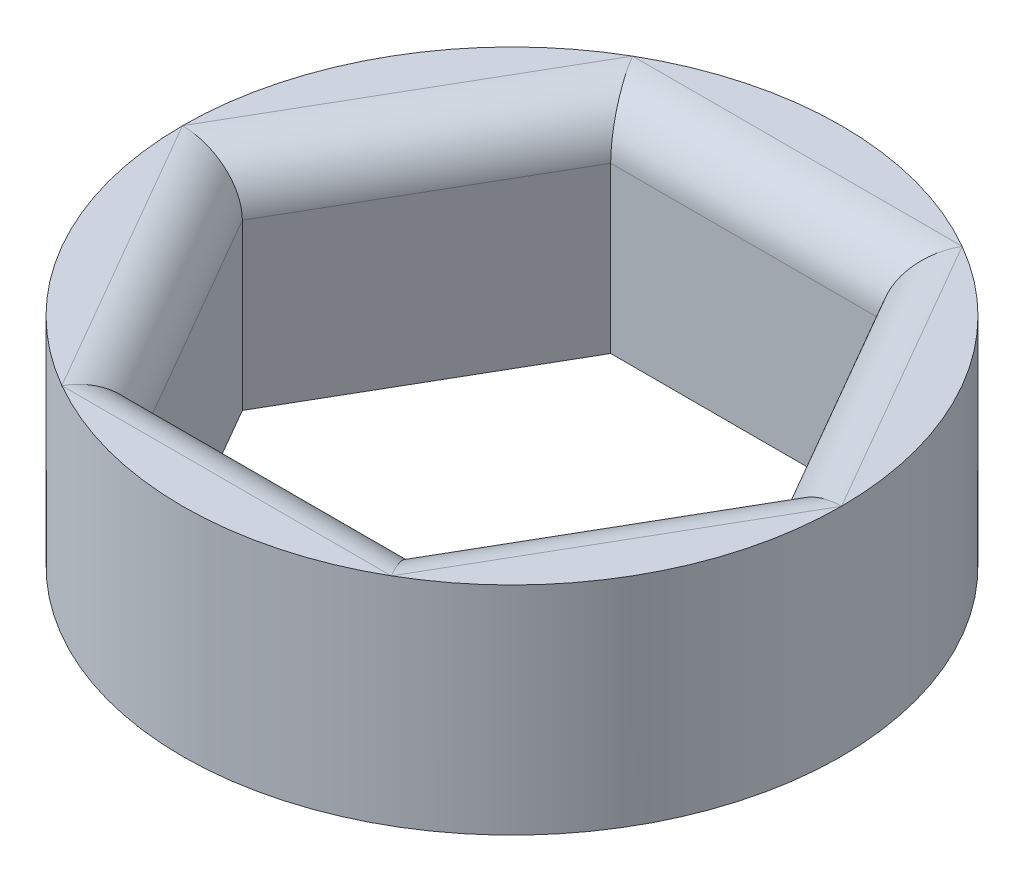
ISO-10303-21;
HEADER;
FILE_DESCRIPTION(('STEP AP214'),'2;1');
FILE_NAME('part.step','',(''),(''),'','','');
FILE_SCHEMA(('AUTOMOTIVE_DESIGN { 1 0 10303 214 1 1 1 1 }'));
ENDSEC;
DATA;
#1=APPLICATION_CONTEXT('core data for automotive mechanical design processes');
#2=APPLICATION_PROTOCOL_DEFINITION('international standard','automotive_design',2000,#1);
#3=PRODUCT_CONTEXT('',#1,'mechanical');
#4=PRODUCT('Part','Part','',(#3));
#5=PRODUCT_RELATED_PRODUCT_CATEGORY('part','',(#4));
#6=PRODUCT_DEFINITION_FORMATION('','',#4);
#7=PRODUCT_DEFINITION_CONTEXT('part definition',#1,'design');
#8=PRODUCT_DEFINITION('design','',#6,#7);
#9=PRODUCT_DEFINITION_SHAPE('','',#8);
#10=(LENGTH_UNIT() NAMED_UNIT(*) SI_UNIT(.MILLI.,.METRE.));
#11=(NAMED_UNIT(*) PLANE_ANGLE_UNIT() SI_UNIT($,.RADIAN.));
#12=(NAMED_UNIT(*) SI_UNIT($,.STERADIAN.) SOLID_ANGLE_UNIT());
#13=UNCERTAINTY_MEASURE_WITH_UNIT(LENGTH_MEASURE(1.E-05),#10,'distance_accuracy_value','');
#14=(GEOMETRIC_REPRESENTATION_CONTEXT(3) GLOBAL_UNCERTAINTY_ASSIGNED_CONTEXT((#13)) GLOBAL_UNIT_ASSIGNED_CONTEXT((#10,
#11,#12)) REPRESENTATION_CONTEXT('',''));
#15=CARTESIAN_POINT('',(0.,0.,0.));
#16=DIRECTION('',(0.,0.,1.));
#17=DIRECTION('',(1.,0.,0.));
#18=AXIS2_PLACEMENT_3D('',#15,#16,#17);
#19=CARTESIAN_POINT('',(0.,4.175,0.));
#20=DIRECTION('',(0.,1.,0.));
#21=DIRECTION('',(0.,0.,1.));
#22=AXIS2_PLACEMENT_3D('',#19,#20,#21);
#23=PLANE('',#22);
#24=CARTESIAN_POINT('',(0.,4.175,0.));
#25=DIRECTION('',(0.,1.,0.));
#26=DIRECTION('',(0.,0.,1.));
#27=AXIS2_PLACEMENT_3D('',#24,#25,#26);
#28=CIRCLE('',#27,6.35);
#29=CARTESIAN_POINT('',(3.17372021451167,4.175,-5.5));
#30=VERTEX_POINT('',#29);
#31=CARTESIAN_POINT('',(-3.17372021451167,4.175,-5.5));
#32=VERTEX_POINT('',#31);
#33=EDGE_CURVE('E349',#30,#32,#28,.T.);
#34=ORIENTED_EDGE('',*,*,#33,.T.);
#35=DIRECTION('',(-1.,0.,0.));
#36=VECTOR('',#35,1.);
#37=CARTESIAN_POINT('',(0.,4.175,-5.5));
#38=LINE('',#37,#36);
#39=EDGE_CURVE('E232',#32,#30,#38,.F.);
#40=ORIENTED_EDGE('',*,*,#39,.T.);
#41=EDGE_LOOP('',(#34,#40));
#42=FACE_BOUND('',#41,.T.);
#43=ADVANCED_FACE('F39',(#42),#23,.T.);
#44=CARTESIAN_POINT('',(-6.34999982807025,4.175,0.00147766972869714));
#45=VERTEX_POINT('',#44);
#46=CARTESIAN_POINT('',(-3.17627961355858,4.175,5.4985223302713));
#47=VERTEX_POINT('',#46);
#48=EDGE_CURVE('E377',#45,#47,#28,.T.);
#49=ORIENTED_EDGE('',*,*,#48,.T.);
#50=DIRECTION('',(0.5,0.,0.866025403784439));
#51=VECTOR('',#50,1.);
#52=CARTESIAN_POINT('',(-4.76313972081442,4.175,2.75));
#53=LINE('',#52,#51);
#54=EDGE_CURVE('E229',#47,#45,#53,.F.);
#55=ORIENTED_EDGE('',*,*,#54,.T.);
#56=EDGE_LOOP('',(#49,#55));
#57=FACE_BOUND('',#56,.T.);
#58=ADVANCED_FACE('F309',(#57),#23,.T.);
#59=CARTESIAN_POINT('',(-3.17372021451167,4.175,5.5));
#60=VERTEX_POINT('',#59);
#61=CARTESIAN_POINT('',(3.17372021451167,4.175,5.5));
#62=VERTEX_POINT('',#61);
#63=EDGE_CURVE('E210',#60,#62,#28,.T.);
#64=ORIENTED_EDGE('',*,*,#63,.T.);
#65=DIRECTION('',(1.,0.,0.));
#66=VECTOR('',#65,1.);
#67=CARTESIAN_POINT('',(0.,4.175,5.5));
#68=LINE('',#67,#66);
#69=EDGE_CURVE('E226',#62,#60,#68,.F.);
#70=ORIENTED_EDGE('',*,*,#69,.T.);
#71=EDGE_LOOP('',(#64,#70));
#72=FACE_BOUND('',#71,.T.);
#73=ADVANCED_FACE('F316',(#72),#23,.T.);
#74=CARTESIAN_POINT('',(3.17627961355858,4.175,5.4985223302713));
#75=VERTEX_POINT('',#74);
#76=CARTESIAN_POINT('',(6.34999982807025,4.175,0.00147766972869324));
#77=VERTEX_POINT('',#76);
#78=EDGE_CURVE('E365',#75,#77,#28,.T.);
#79=ORIENTED_EDGE('',*,*,#78,.T.);
#80=DIRECTION('',(0.5,0.,-0.866025403784439));
#81=VECTOR('',#80,1.);
#82=CARTESIAN_POINT('',(4.76313972081441,4.175,2.75));
#83=LINE('',#82,#81);
#84=EDGE_CURVE('E223',#77,#75,#83,.F.);
#85=ORIENTED_EDGE('',*,*,#84,.T.);
#86=EDGE_LOOP('',(#79,#85));
#87=FACE_BOUND('',#86,.T.);
#88=ADVANCED_FACE('F330',(#87),#23,.T.);
#89=CARTESIAN_POINT('',(6.34999982807025,4.175,-0.00147766972869194));
#90=VERTEX_POINT('',#89);
#91=CARTESIAN_POINT('',(3.17627961355858,4.175,-5.49852233027131));
#92=VERTEX_POINT('',#91);
#93=EDGE_CURVE('E358',#90,#92,#28,.T.);
#94=ORIENTED_EDGE('',*,*,#93,.T.);
#95=DIRECTION('',(-0.5,0.,-0.866025403784439));
#96=VECTOR('',#95,1.);
#97=CARTESIAN_POINT('',(4.76313972081441,4.175,-2.75));
#98=LINE('',#97,#96);
#99=EDGE_CURVE('E220',#92,#90,#98,.F.);
#100=ORIENTED_EDGE('',*,*,#99,.T.);
#101=EDGE_LOOP('',(#94,#100));
#102=FACE_BOUND('',#101,.T.);
#103=ADVANCED_FACE('F322',(#102),#23,.T.);
#104=CARTESIAN_POINT('',(-3.17627961355858,4.175,-5.4985223302713));
#105=VERTEX_POINT('',#104);
#106=CARTESIAN_POINT('',(-6.34999982807025,4.175,-0.00147766972869454));
#107=VERTEX_POINT('',#106);
#108=EDGE_CURVE('E334',#105,#107,#28,.T.);
#109=ORIENTED_EDGE('',*,*,#108,.T.);
#110=DIRECTION('',(-0.5,0.,0.866025403784439));
#111=VECTOR('',#110,1.);
#112=CARTESIAN_POINT('',(-4.76313972081441,4.175,-2.75));
#113=LINE('',#112,#111);
#114=EDGE_CURVE('E217',#107,#105,#113,.F.);
#115=ORIENTED_EDGE('',*,*,#114,.T.);
#116=EDGE_LOOP('',(#109,#115));
#117=FACE_BOUND('',#116,.T.);
#118=ADVANCED_FACE('F312',(#117),#23,.T.);
#119=CARTESIAN_POINT('',(0.,0.,0.));
#120=DIRECTION('',(0.,1.,0.));
#121=DIRECTION('',(0.,0.,1.));
#122=AXIS2_PLACEMENT_3D('',#119,#120,#121);
#123=PLANE('',#122);
#124=CARTESIAN_POINT('',(0.,0.,0.));
#125=DIRECTION('',(0.,1.,0.));
#126=DIRECTION('',(0.,0.,1.));
#127=AXIS2_PLACEMENT_3D('',#124,#125,#126);
#128=CIRCLE('',#127,6.35);
#129=CARTESIAN_POINT('',(0.,0.,6.35));
#130=VERTEX_POINT('',#129);
#131=EDGE_CURVE('E156',#130,#130,#128,.T.);
#132=ORIENTED_EDGE('',*,*,#131,.F.);
#133=EDGE_LOOP('',(#132));
#134=FACE_BOUND('',#133,.T.);
#135=DIRECTION('',(0.5,0.,-0.866025403784439));
#136=VECTOR('',#135,1.);
#137=CARTESIAN_POINT('',(2.59807621135331,0.,4.5));
#138=LINE('',#137,#136);
#139=CARTESIAN_POINT('',(2.59807621135331,0.,4.5));
#140=VERTEX_POINT('',#139);
#141=CARTESIAN_POINT('',(5.19615242270663,0.,0.));
#142=VERTEX_POINT('',#141);
#143=EDGE_CURVE('E151',#140,#142,#138,.T.);
#144=ORIENTED_EDGE('',*,*,#143,.T.);
#145=DIRECTION('',(-0.5,0.,-0.866025403784439));
#146=VECTOR('',#145,1.);
#147=CARTESIAN_POINT('',(5.19615242270663,0.,0.));
#148=LINE('',#147,#146);
#149=CARTESIAN_POINT('',(2.59807621135331,0.,-4.5));
#150=VERTEX_POINT('',#149);
#151=EDGE_CURVE('E160',#142,#150,#148,.T.);
#152=ORIENTED_EDGE('',*,*,#151,.T.);
#153=DIRECTION('',(-1.,0.,0.));
#154=VECTOR('',#153,1.);
#155=CARTESIAN_POINT('',(2.59807621135331,0.,-4.5));
#156=LINE('',#155,#154);
#157=CARTESIAN_POINT('',(-2.59807621135332,0.,-4.5));
#158=VERTEX_POINT('',#157);
#159=EDGE_CURVE('E167',#150,#158,#156,.T.);
#160=ORIENTED_EDGE('',*,*,#159,.T.);
#161=DIRECTION('',(-0.5,0.,0.866025403784439));
#162=VECTOR('',#161,1.);
#163=CARTESIAN_POINT('',(-2.59807621135332,0.,-4.5));
#164=LINE('',#163,#162);
#165=CARTESIAN_POINT('',(-5.19615242270663,0.,0.));
#166=VERTEX_POINT('',#165);
#167=EDGE_CURVE('E181',#158,#166,#164,.T.);
#168=ORIENTED_EDGE('',*,*,#167,.T.);
#169=DIRECTION('',(0.5,0.,0.866025403784439));
#170=VECTOR('',#169,1.);
#171=CARTESIAN_POINT('',(-5.19615242270663,0.,0.));
#172=LINE('',#171,#170);
#173=CARTESIAN_POINT('',(-2.59807621135332,0.,4.5));
#174=VERTEX_POINT('',#173);
#175=EDGE_CURVE('E185',#166,#174,#172,.T.);
#176=ORIENTED_EDGE('',*,*,#175,.T.);
#177=DIRECTION('',(1.,0.,0.));
#178=VECTOR('',#177,1.);
#179=CARTESIAN_POINT('',(-2.59807621135332,0.,4.5));
#180=LINE('',#179,#178);
#181=EDGE_CURVE('E172',#174,#140,#180,.T.);
#182=ORIENTED_EDGE('',*,*,#181,.T.);
#183=EDGE_LOOP('',(#144,#152,#160,#168,#176,#182));
#184=FACE_BOUND('',#183,.T.);
#185=ADVANCED_FACE('F169',(#134,#184),#123,.F.);
#186=CARTESIAN_POINT('',(0.,4.175,0.));
#187=DIRECTION('',(0.,-1.,0.));
#188=DIRECTION('',(0.,0.,-1.));
#189=AXIS2_PLACEMENT_3D('',#186,#187,#188);
#190=CYLINDRICAL_SURFACE('',#189,6.35);
#191=CARTESIAN_POINT('',(3.175,4.175,5.49926131403119));
#192=VERTEX_POINT('',#191);
#193=EDGE_CURVE('E204',#62,#192,#28,.T.);
#194=ORIENTED_EDGE('',*,*,#193,.F.);
#195=ORIENTED_EDGE('',*,*,#63,.F.);
#196=CARTESIAN_POINT('',(-3.175,4.175,5.49926131403118));
#197=VERTEX_POINT('',#196);
#198=EDGE_CURVE('E272',#197,#60,#28,.T.);
#199=ORIENTED_EDGE('',*,*,#198,.F.);
#200=EDGE_CURVE('E268',#47,#197,#28,.T.);
#201=ORIENTED_EDGE('',*,*,#200,.F.);
#202=ORIENTED_EDGE('',*,*,#48,.F.);
#203=CARTESIAN_POINT('',(-6.35,4.175,0.));
#204=VERTEX_POINT('',#203);
#205=EDGE_CURVE('E380',#204,#45,#28,.T.);
#206=ORIENTED_EDGE('',*,*,#205,.F.);
#207=EDGE_CURVE('E340',#107,#204,#28,.T.);
#208=ORIENTED_EDGE('',*,*,#207,.F.);
#209=ORIENTED_EDGE('',*,*,#108,.F.);
#210=CARTESIAN_POINT('',(-3.175,4.175,-5.49926131403119));
#211=VERTEX_POINT('',#210);
#212=EDGE_CURVE('E339',#211,#105,#28,.T.);
#213=ORIENTED_EDGE('',*,*,#212,.F.);
#214=EDGE_CURVE('E347',#32,#211,#28,.T.);
#215=ORIENTED_EDGE('',*,*,#214,.F.);
#216=ORIENTED_EDGE('',*,*,#33,.F.);
#217=CARTESIAN_POINT('',(3.175,4.175,-5.49926131403119));
#218=VERTEX_POINT('',#217);
#219=EDGE_CURVE('E353',#218,#30,#28,.T.);
#220=ORIENTED_EDGE('',*,*,#219,.F.);
#221=EDGE_CURVE('E356',#92,#218,#28,.T.);
#222=ORIENTED_EDGE('',*,*,#221,.F.);
#223=ORIENTED_EDGE('',*,*,#93,.F.);
#224=CARTESIAN_POINT('',(6.35,4.175,0.));
#225=VERTEX_POINT('',#224);
#226=EDGE_CURVE('E361',#225,#90,#28,.T.);
#227=ORIENTED_EDGE('',*,*,#226,.F.);
#228=EDGE_CURVE('E281',#77,#225,#28,.T.);
#229=ORIENTED_EDGE('',*,*,#228,.F.);
#230=ORIENTED_EDGE('',*,*,#78,.F.);
#231=EDGE_CURVE('E209',#192,#75,#28,.T.);
#232=ORIENTED_EDGE('',*,*,#231,.F.);
#233=EDGE_LOOP('',(#194,#195,#199,#201,#202,#206,#208,#209,#213,#215,#216,#220,#222,#223,#227,
#229,#230,#232));
#234=FACE_BOUND('',#233,.T.);
#235=ORIENTED_EDGE('',*,*,#131,.T.);
#236=EDGE_LOOP('',(#235));
#237=FACE_BOUND('',#236,.T.);
#238=ADVANCED_FACE('F328',(#234,#237),#190,.T.);
#239=CARTESIAN_POINT('',(2.59807621135331,4.175,4.5));
#240=DIRECTION('',(-0.866025403784439,0.,-0.5));
#241=DIRECTION('',(-0.5,0.,0.866025403784439));
#242=AXIS2_PLACEMENT_3D('',#239,#240,#241);
#243=PLANE('',#242);
#244=DIRECTION('',(0.,-1.,0.));
#245=VECTOR('',#244,1.);
#246=CARTESIAN_POINT('',(2.59807621135331,4.175,4.5));
#247=LINE('',#246,#245);
#248=CARTESIAN_POINT('',(2.59807621135331,3.175,4.5));
#249=VERTEX_POINT('',#248);
#250=EDGE_CURVE('E190',#249,#140,#247,.T.);
#251=ORIENTED_EDGE('',*,*,#250,.F.);
#252=DIRECTION('',(0.5,0.,-0.866025403784439));
#253=VECTOR('',#252,1.);
#254=CARTESIAN_POINT('',(2.59807621135331,3.175,4.5));
#255=LINE('',#254,#253);
#256=CARTESIAN_POINT('',(5.19615242270663,3.175,0.));
#257=VERTEX_POINT('',#256);
#258=EDGE_CURVE('E57',#249,#257,#255,.T.);
#259=ORIENTED_EDGE('',*,*,#258,.T.);
#260=DIRECTION('',(0.,-1.,0.));
#261=VECTOR('',#260,1.);
#262=CARTESIAN_POINT('',(5.19615242270663,4.175,0.));
#263=LINE('',#262,#261);
#264=EDGE_CURVE('E147',#257,#142,#263,.T.);
#265=ORIENTED_EDGE('',*,*,#264,.T.);
#266=ORIENTED_EDGE('',*,*,#143,.F.);
#267=EDGE_LOOP('',(#251,#259,#265,#266));
#268=FACE_BOUND('',#267,.T.);
#269=ADVANCED_FACE('F149',(#268),#243,.T.);
#270=CARTESIAN_POINT('',(5.19615242270663,4.175,0.));
#271=DIRECTION('',(-0.866025403784439,0.,0.5));
#272=DIRECTION('',(0.5,0.,0.866025403784439));
#273=AXIS2_PLACEMENT_3D('',#270,#271,#272);
#274=PLANE('',#273);
#275=ORIENTED_EDGE('',*,*,#264,.F.);
#276=DIRECTION('',(-0.5,0.,-0.866025403784439));
#277=VECTOR('',#276,1.);
#278=CARTESIAN_POINT('',(5.19615242270663,3.175,0.));
#279=LINE('',#278,#277);
#280=CARTESIAN_POINT('',(2.59807621135331,3.175,-4.5));
#281=VERTEX_POINT('',#280);
#282=EDGE_CURVE('E49',#257,#281,#279,.T.);
#283=ORIENTED_EDGE('',*,*,#282,.T.);
#284=DIRECTION('',(0.,-1.,0.));
#285=VECTOR('',#284,1.);
#286=CARTESIAN_POINT('',(2.59807621135331,4.175,-4.5));
#287=LINE('',#286,#285);
#288=EDGE_CURVE('E157',#281,#150,#287,.T.);
#289=ORIENTED_EDGE('',*,*,#288,.T.);
#290=ORIENTED_EDGE('',*,*,#151,.F.);
#291=EDGE_LOOP('',(#275,#283,#289,#290));
#292=FACE_BOUND('',#291,.T.);
#293=ADVANCED_FACE('F161',(#292),#274,.T.);
#294=CARTESIAN_POINT('',(2.59807621135331,4.175,-4.5));
#295=DIRECTION('',(0.,0.,1.));
#296=DIRECTION('',(1.,0.,0.));
#297=AXIS2_PLACEMENT_3D('',#294,#295,#296);
#298=PLANE('',#297);
#299=ORIENTED_EDGE('',*,*,#288,.F.);
#300=DIRECTION('',(-1.,0.,0.));
#301=VECTOR('',#300,1.);
#302=CARTESIAN_POINT('',(2.59807621135331,3.175,-4.5));
#303=LINE('',#302,#301);
#304=CARTESIAN_POINT('',(-2.59807621135332,3.175,-4.5));
#305=VERTEX_POINT('',#304);
#306=EDGE_CURVE('E208',#281,#305,#303,.T.);
#307=ORIENTED_EDGE('',*,*,#306,.T.);
#308=DIRECTION('',(0.,-1.,0.));
#309=VECTOR('',#308,1.);
#310=CARTESIAN_POINT('',(-2.59807621135332,4.175,-4.5));
#311=LINE('',#310,#309);
#312=EDGE_CURVE('E199',#305,#158,#311,.T.);
#313=ORIENTED_EDGE('',*,*,#312,.T.);
#314=ORIENTED_EDGE('',*,*,#159,.F.);
#315=EDGE_LOOP('',(#299,#307,#313,#314));
#316=FACE_BOUND('',#315,.T.);
#317=ADVANCED_FACE('F290',(#316),#298,.T.);
#318=CARTESIAN_POINT('',(-2.59807621135332,4.175,-4.5));
#319=DIRECTION('',(0.866025403784439,0.,0.5));
#320=DIRECTION('',(0.5,0.,-0.866025403784439));
#321=AXIS2_PLACEMENT_3D('',#318,#319,#320);
#322=PLANE('',#321);
#323=ORIENTED_EDGE('',*,*,#312,.F.);
#324=DIRECTION('',(-0.5,0.,0.866025403784439));
#325=VECTOR('',#324,1.);
#326=CARTESIAN_POINT('',(-2.59807621135332,3.175,-4.5));
#327=LINE('',#326,#325);
#328=CARTESIAN_POINT('',(-5.19615242270663,3.175,0.));
#329=VERTEX_POINT('',#328);
#330=EDGE_CURVE('E11',#305,#329,#327,.T.);
#331=ORIENTED_EDGE('',*,*,#330,.T.);
#332=DIRECTION('',(0.,-1.,0.));
#333=VECTOR('',#332,1.);
#334=CARTESIAN_POINT('',(-5.19615242270663,4.175,0.));
#335=LINE('',#334,#333);
#336=EDGE_CURVE('E196',#329,#166,#335,.T.);
#337=ORIENTED_EDGE('',*,*,#336,.T.);
#338=ORIENTED_EDGE('',*,*,#167,.F.);
#339=EDGE_LOOP('',(#323,#331,#337,#338));
#340=FACE_BOUND('',#339,.T.);
#341=ADVANCED_FACE('F295',(#340),#322,.T.);
#342=CARTESIAN_POINT('',(-5.19615242270663,4.175,0.));
#343=DIRECTION('',(0.866025403784439,0.,-0.5));
#344=DIRECTION('',(-0.5,0.,-0.866025403784439));
#345=AXIS2_PLACEMENT_3D('',#342,#343,#344);
#346=PLANE('',#345);
#347=ORIENTED_EDGE('',*,*,#336,.F.);
#348=DIRECTION('',(0.5,0.,0.866025403784439));
#349=VECTOR('',#348,1.);
#350=CARTESIAN_POINT('',(-5.19615242270663,3.175,0.));
#351=LINE('',#350,#349);
#352=CARTESIAN_POINT('',(-2.59807621135332,3.175,4.5));
#353=VERTEX_POINT('',#352);
#354=EDGE_CURVE('E236',#329,#353,#351,.T.);
#355=ORIENTED_EDGE('',*,*,#354,.T.);
#356=DIRECTION('',(0.,-1.,0.));
#357=VECTOR('',#356,1.);
#358=CARTESIAN_POINT('',(-2.59807621135332,4.175,4.5));
#359=LINE('',#358,#357);
#360=EDGE_CURVE('E193',#353,#174,#359,.T.);
#361=ORIENTED_EDGE('',*,*,#360,.T.);
#362=ORIENTED_EDGE('',*,*,#175,.F.);
#363=EDGE_LOOP('',(#347,#355,#361,#362));
#364=FACE_BOUND('',#363,.T.);
#365=ADVANCED_FACE('F299',(#364),#346,.T.);
#366=CARTESIAN_POINT('',(-2.59807621135332,4.175,4.5));
#367=DIRECTION('',(0.,0.,-1.));
#368=DIRECTION('',(-1.,0.,0.));
#369=AXIS2_PLACEMENT_3D('',#366,#367,#368);
#370=PLANE('',#369);
#371=ORIENTED_EDGE('',*,*,#360,.F.);
#372=DIRECTION('',(1.,0.,0.));
#373=VECTOR('',#372,1.);
#374=CARTESIAN_POINT('',(-2.59807621135332,3.175,4.5));
#375=LINE('',#374,#373);
#376=EDGE_CURVE('E65',#353,#249,#375,.T.);
#377=ORIENTED_EDGE('',*,*,#376,.T.);
#378=ORIENTED_EDGE('',*,*,#250,.T.);
#379=ORIENTED_EDGE('',*,*,#181,.F.);
#380=EDGE_LOOP('',(#371,#377,#378,#379));
#381=FACE_BOUND('',#380,.T.);
#382=ADVANCED_FACE('F300',(#381),#370,.T.);
#383=CARTESIAN_POINT('',(-2.59807621135332,3.175,5.5));
#384=DIRECTION('',(1.,0.,0.));
#385=DIRECTION('',(0.,0.,-1.));
#386=AXIS2_PLACEMENT_3D('',#383,#384,#385);
#387=CYLINDRICAL_SURFACE('',#386,1.);
#388=ORIENTED_EDGE('',*,*,#69,.F.);
#389=ORIENTED_EDGE('',*,*,#193,.T.);
#390=CARTESIAN_POINT('',(3.17542648054294,3.175,5.5));
#391=DIRECTION('',(0.866025403784439,0.,-0.5));
#392=DIRECTION('',(-0.5,0.,-0.866025403784439));
#393=AXIS2_PLACEMENT_3D('',#390,#391,#392);
#394=ELLIPSE('',#393,1.15470053837925,1.);
#395=EDGE_CURVE('E43',#249,#192,#394,.T.);
#396=ORIENTED_EDGE('',*,*,#395,.F.);
#397=ORIENTED_EDGE('',*,*,#376,.F.);
#398=CARTESIAN_POINT('',(-3.17542648054294,3.175,5.5));
#399=DIRECTION('',(0.866025403784438,0.,0.5));
#400=DIRECTION('',(0.5,0.,-0.866025403784439));
#401=AXIS2_PLACEMENT_3D('',#398,#399,#400);
#402=ELLIPSE('',#401,1.15470053837925,1.);
#403=EDGE_CURVE('E177',#197,#353,#402,.F.);
#404=ORIENTED_EDGE('',*,*,#403,.F.);
#405=ORIENTED_EDGE('',*,*,#198,.T.);
#406=EDGE_LOOP('',(#388,#389,#396,#397,#404,#405));
#407=FACE_BOUND('',#406,.T.);
#408=ADVANCED_FACE('F41',(#407),#387,.T.);
#409=CARTESIAN_POINT('',(3.46410161513775,3.175,5.));
#410=DIRECTION('',(0.5,0.,-0.866025403784439));
#411=DIRECTION('',(-0.866025403784439,0.,-0.5));
#412=AXIS2_PLACEMENT_3D('',#409,#410,#411);
#413=CYLINDRICAL_SURFACE('',#412,1.);
#414=ORIENTED_EDGE('',*,*,#84,.F.);
#415=ORIENTED_EDGE('',*,*,#228,.T.);
#416=CARTESIAN_POINT('',(6.35085296108588,3.175,0.));
#417=DIRECTION('',(0.,0.,-1.));
#418=DIRECTION('',(-1.,0.,0.));
#419=AXIS2_PLACEMENT_3D('',#416,#417,#418);
#420=ELLIPSE('',#419,1.15470053837925,1.);
#421=EDGE_CURVE('E256',#257,#225,#420,.T.);
#422=ORIENTED_EDGE('',*,*,#421,.F.);
#423=ORIENTED_EDGE('',*,*,#258,.F.);
#424=ORIENTED_EDGE('',*,*,#395,.T.);
#425=ORIENTED_EDGE('',*,*,#231,.T.);
#426=EDGE_LOOP('',(#414,#415,#422,#423,#424,#425));
#427=FACE_BOUND('',#426,.T.);
#428=ADVANCED_FACE('F278',(#427),#413,.T.);
#429=CARTESIAN_POINT('',(-6.06217782649107,3.175,0.500000000000001));
#430=DIRECTION('',(0.5,0.,0.866025403784439));
#431=DIRECTION('',(0.866025403784439,0.,-0.5));
#432=AXIS2_PLACEMENT_3D('',#429,#430,#431);
#433=CYLINDRICAL_SURFACE('',#432,1.);
#434=ORIENTED_EDGE('',*,*,#403,.T.);
#435=ORIENTED_EDGE('',*,*,#354,.F.);
#436=CARTESIAN_POINT('',(-6.35085296108588,3.175,0.));
#437=DIRECTION('',(0.,0.,1.));
#438=DIRECTION('',(-1.,0.,0.));
#439=AXIS2_PLACEMENT_3D('',#436,#437,#438);
#440=ELLIPSE('',#439,1.15470053837925,1.);
#441=EDGE_CURVE('E252',#204,#329,#440,.F.);
#442=ORIENTED_EDGE('',*,*,#441,.F.);
#443=ORIENTED_EDGE('',*,*,#205,.T.);
#444=ORIENTED_EDGE('',*,*,#54,.F.);
#445=ORIENTED_EDGE('',*,*,#200,.T.);
#446=EDGE_LOOP('',(#434,#435,#442,#443,#444,#445));
#447=FACE_BOUND('',#446,.T.);
#448=ADVANCED_FACE('F265',(#447),#433,.T.);
#449=CARTESIAN_POINT('',(6.06217782649107,3.175,-0.499999999999999));
#450=DIRECTION('',(-0.5,0.,-0.866025403784439));
#451=DIRECTION('',(-0.866025403784439,0.,0.5));
#452=AXIS2_PLACEMENT_3D('',#449,#450,#451);
#453=CYLINDRICAL_SURFACE('',#452,1.);
#454=ORIENTED_EDGE('',*,*,#99,.F.);
#455=ORIENTED_EDGE('',*,*,#221,.T.);
#456=CARTESIAN_POINT('',(3.17542648054294,3.175,-5.5));
#457=DIRECTION('',(-0.866025403784438,0.,-0.5));
#458=DIRECTION('',(0.5,0.,-0.866025403784439));
#459=AXIS2_PLACEMENT_3D('',#456,#457,#458);
#460=ELLIPSE('',#459,1.15470053837925,1.);
#461=EDGE_CURVE('E248',#281,#218,#460,.T.);
#462=ORIENTED_EDGE('',*,*,#461,.F.);
#463=ORIENTED_EDGE('',*,*,#282,.F.);
#464=ORIENTED_EDGE('',*,*,#421,.T.);
#465=ORIENTED_EDGE('',*,*,#226,.T.);
#466=EDGE_LOOP('',(#454,#455,#462,#463,#464,#465));
#467=FACE_BOUND('',#466,.T.);
#468=ADVANCED_FACE('F286',(#467),#453,.T.);
#469=CARTESIAN_POINT('',(-3.46410161513775,3.175,-5.));
#470=DIRECTION('',(-0.5,0.,0.866025403784439));
#471=DIRECTION('',(0.866025403784439,0.,0.5));
#472=AXIS2_PLACEMENT_3D('',#469,#470,#471);
#473=CYLINDRICAL_SURFACE('',#472,1.);
#474=ORIENTED_EDGE('',*,*,#441,.T.);
#475=ORIENTED_EDGE('',*,*,#330,.F.);
#476=CARTESIAN_POINT('',(-3.17542648054294,3.175,-5.5));
#477=DIRECTION('',(-0.866025403784439,0.,0.5));
#478=DIRECTION('',(0.5,0.,0.866025403784439));
#479=AXIS2_PLACEMENT_3D('',#476,#477,#478);
#480=ELLIPSE('',#479,1.15470053837925,1.);
#481=EDGE_CURVE('E245',#211,#305,#480,.F.);
#482=ORIENTED_EDGE('',*,*,#481,.F.);
#483=ORIENTED_EDGE('',*,*,#212,.T.);
#484=ORIENTED_EDGE('',*,*,#114,.F.);
#485=ORIENTED_EDGE('',*,*,#207,.T.);
#486=EDGE_LOOP('',(#474,#475,#482,#483,#484,#485));
#487=FACE_BOUND('',#486,.T.);
#488=ADVANCED_FACE('F343',(#487),#473,.T.);
#489=CARTESIAN_POINT('',(2.59807621135331,3.175,-5.5));
#490=DIRECTION('',(-1.,0.,0.));
#491=DIRECTION('',(0.,0.,1.));
#492=AXIS2_PLACEMENT_3D('',#489,#490,#491);
#493=CYLINDRICAL_SURFACE('',#492,1.);
#494=ORIENTED_EDGE('',*,*,#219,.T.);
#495=ORIENTED_EDGE('',*,*,#39,.F.);
#496=ORIENTED_EDGE('',*,*,#214,.T.);
#497=ORIENTED_EDGE('',*,*,#481,.T.);
#498=ORIENTED_EDGE('',*,*,#306,.F.);
#499=ORIENTED_EDGE('',*,*,#461,.T.);
#500=EDGE_LOOP('',(#494,#495,#496,#497,#498,#499));
#501=FACE_BOUND('',#500,.T.);
#502=ADVANCED_FACE('F488',(#501),#493,.T.);
#503=CLOSED_SHELL('',(#43,#58,#73,#88,#103,#118,#185,#238,#269,#293,#317,#341,#365,#382,#408,
#428,#448,#468,#488,#502));
#504=MANIFOLD_SOLID_BREP('B2',#503);
#505=ADVANCED_BREP_SHAPE_REPRESENTATION('',(#18,#504),#14);
#506=SHAPE_DEFINITION_REPRESENTATION(#9,#505);
ENDSEC;
END-ISO-10303-21;
